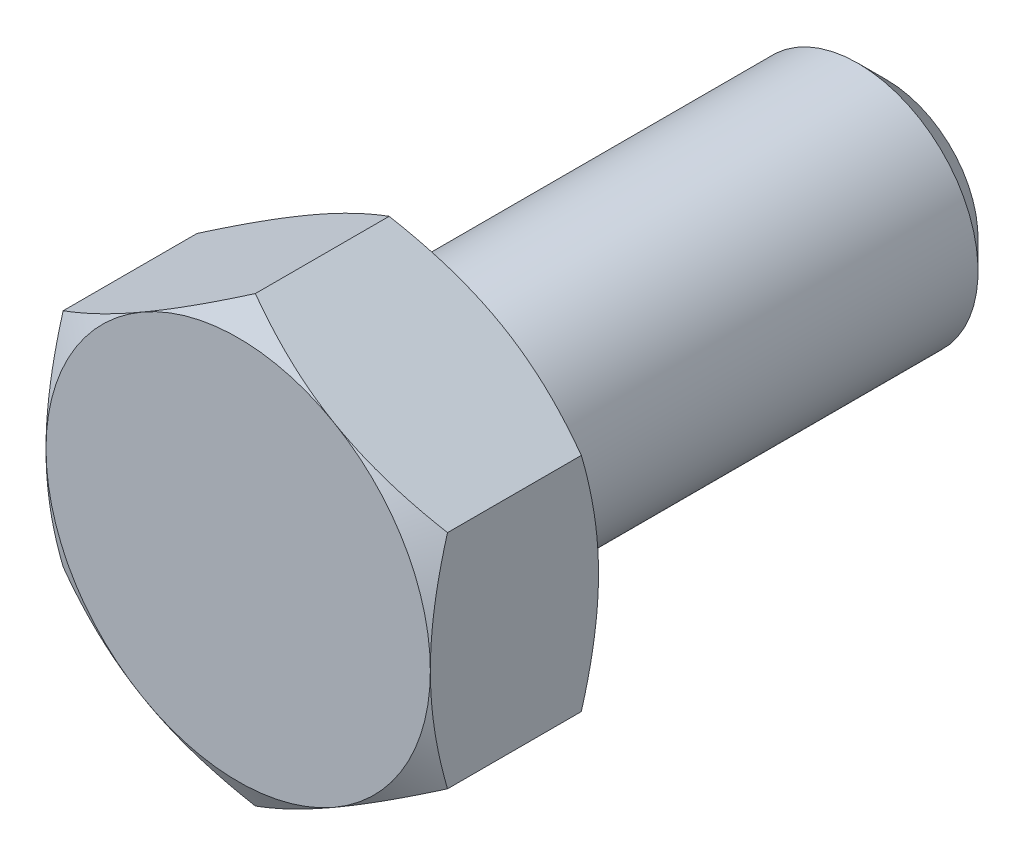
ISO-10303-21;
HEADER;
FILE_DESCRIPTION(('STEP AP214'),'2;1');
FILE_NAME('part.step','',(''),(''),'','','');
FILE_SCHEMA(('AUTOMOTIVE_DESIGN { 1 0 10303 214 1 1 1 1 }'));
ENDSEC;
DATA;
#1=APPLICATION_CONTEXT('core data for automotive mechanical design processes');
#2=APPLICATION_PROTOCOL_DEFINITION('international standard','automotive_design',2000,#1);
#3=PRODUCT_CONTEXT('',#1,'mechanical');
#4=PRODUCT('Part','Part','',(#3));
#5=PRODUCT_RELATED_PRODUCT_CATEGORY('part','',(#4));
#6=PRODUCT_DEFINITION_FORMATION('','',#4);
#7=PRODUCT_DEFINITION_CONTEXT('part definition',#1,'design');
#8=PRODUCT_DEFINITION('design','',#6,#7);
#9=PRODUCT_DEFINITION_SHAPE('','',#8);
#10=(LENGTH_UNIT() NAMED_UNIT(*) SI_UNIT(.MILLI.,.METRE.));
#11=(NAMED_UNIT(*) PLANE_ANGLE_UNIT() SI_UNIT($,.RADIAN.));
#12=(NAMED_UNIT(*) SI_UNIT($,.STERADIAN.) SOLID_ANGLE_UNIT());
#13=UNCERTAINTY_MEASURE_WITH_UNIT(LENGTH_MEASURE(1.E-05),#10,'distance_accuracy_value','');
#14=(GEOMETRIC_REPRESENTATION_CONTEXT(3) GLOBAL_UNCERTAINTY_ASSIGNED_CONTEXT((#13)) GLOBAL_UNIT_ASSIGNED_CONTEXT((#10,
#11,#12)) REPRESENTATION_CONTEXT('',''));
#15=CARTESIAN_POINT('',(0.,0.,0.));
#16=DIRECTION('',(0.,0.,1.));
#17=DIRECTION('',(1.,0.,0.));
#18=AXIS2_PLACEMENT_3D('',#15,#16,#17);
#19=CARTESIAN_POINT('',(4.,2.3094010767585,-15.7202018532156));
#20=DIRECTION('',(0.5,0.866025403784439,0.));
#21=DIRECTION('',(-0.866025403784439,0.5,0.));
#22=AXIS2_PLACEMENT_3D('',#19,#20,#21);
#23=PLANE('',#22);
#24=DIRECTION('',(0.,0.,1.));
#25=VECTOR('',#24,1.);
#26=CARTESIAN_POINT('',(4.,2.3094010767585,-15.7202018532156));
#27=LINE('',#26,#25);
#28=CARTESIAN_POINT('',(4.,2.3094010767585,-3.14273441009184));
#29=VERTEX_POINT('',#28);
#30=CARTESIAN_POINT('',(4.,2.3094010767585,-0.357265589908162));
#31=VERTEX_POINT('',#30);
#32=EDGE_CURVE('E243',#29,#31,#27,.T.);
#33=ORIENTED_EDGE('',*,*,#32,.F.);
#34=CARTESIAN_POINT('',(4.0002,2.30928560670466,-3.14266774092524));
#35=CARTESIAN_POINT('',(3.82442084967677,2.4107717464617,-3.20128212635172));
#36=CARTESIAN_POINT('',(3.64712438367362,2.51313390883499,-3.25458967853774));
#37=CARTESIAN_POINT('',(3.28946140682429,2.71963072479811,-3.3476383292536));
#38=CARTESIAN_POINT('',(3.10908854102985,2.82376904741904,-3.3873465109703));
#39=CARTESIAN_POINT('',(2.75057818129721,3.03075510011795,-3.44915778471973));
#40=CARTESIAN_POINT('',(2.57249584706486,3.13357098372491,-3.47167226847712));
#41=CARTESIAN_POINT('',(2.21549328283349,3.33968651028528,-3.49854937685342));
#42=CARTESIAN_POINT('',(2.0365743503559,3.44298540411433,-3.50293425857306));
#43=CARTESIAN_POINT('',(1.70225715780327,3.63600352522932,-3.49380992706004));
#44=CARTESIAN_POINT('',(1.54680884001294,3.72575165335064,-3.48254104601201));
#45=CARTESIAN_POINT('',(1.23692494436495,3.90466320392054,-3.44682600920182));
#46=CARTESIAN_POINT('',(1.08249043825587,3.99382600759478,-3.42236765428848));
#47=CARTESIAN_POINT('',(0.771967672225422,4.17310641015196,-3.36122393508072));
#48=CARTESIAN_POINT('',(0.615918711936898,4.26320131938131,-3.32427939634515));
#49=CARTESIAN_POINT('',(0.306148164596161,4.4420474282755,-3.24042992745198));
#50=CARTESIAN_POINT('',(0.152422609226221,4.53080091904966,-3.19354469778727));
#51=CARTESIAN_POINT('',(-0.000199999999999762,4.61891762357084,-3.14266774092524));
#52=B_SPLINE_CURVE_WITH_KNOTS('',3,(#34,#35,#36,#37,#38,#39,#40,#41,#42,#43,#44,#45,#46,#47,#48,
#49,#50,#51),.UNSPECIFIED.,.F.,.F.,(4,2,2,2,2,2,2,2,4),(0.,0.634047835695965,1.26961969224543,
1.88946157213122,2.50854226669296,3.04757825393385,3.58711366126903,4.13861653143763,
4.68903648037743),.UNSPECIFIED.);
#53=CARTESIAN_POINT('',(2.,3.46410161513777,-3.5));
#54=VERTEX_POINT('',#53);
#55=EDGE_CURVE('E55',#29,#54,#52,.T.);
#56=ORIENTED_EDGE('',*,*,#55,.T.);
#57=CARTESIAN_POINT('',(0.,4.618802153517,-3.14273441009185));
#58=VERTEX_POINT('',#57);
#59=EDGE_CURVE('E201',#54,#58,#52,.T.);
#60=ORIENTED_EDGE('',*,*,#59,.T.);
#61=DIRECTION('',(0.,0.,1.));
#62=VECTOR('',#61,1.);
#63=CARTESIAN_POINT('',(0.,4.618802153517,-15.7202018532156));
#64=LINE('',#63,#62);
#65=CARTESIAN_POINT('',(0.,4.618802153517,-0.357265589908161));
#66=VERTEX_POINT('',#65);
#67=EDGE_CURVE('E250',#58,#66,#64,.T.);
#68=ORIENTED_EDGE('',*,*,#67,.T.);
#69=CARTESIAN_POINT('',(-0.000200000000000386,4.61891762357084,-0.357332259074766));
#70=CARTESIAN_POINT('',(0.175579150323227,4.5174314838138,-0.298717873648281));
#71=CARTESIAN_POINT('',(0.352875616326379,4.41506932144051,-0.245410321462262));
#72=CARTESIAN_POINT('',(0.710538593175705,4.20857250547739,-0.152361670746403));
#73=CARTESIAN_POINT('',(0.89091145897015,4.10443418285646,-0.112653489029704));
#74=CARTESIAN_POINT('',(1.24942181870279,3.89744813015756,-0.0508422152802788));
#75=CARTESIAN_POINT('',(1.42750415293514,3.79463224655059,-0.0283277315228885));
#76=CARTESIAN_POINT('',(1.78450671716651,3.58851671999022,-0.00145062314658153));
#77=CARTESIAN_POINT('',(1.9634256496441,3.48521782616117,0.00293425857305705));
#78=CARTESIAN_POINT('',(2.29774284219673,3.29219970504618,-0.00619007293996993));
#79=CARTESIAN_POINT('',(2.45319115998706,3.20245157692486,-0.0174589539879939));
#80=CARTESIAN_POINT('',(2.76307505563505,3.02354002635496,-0.0531739907981927));
#81=CARTESIAN_POINT('',(2.91750956174413,2.93437722268072,-0.0776323457115325));
#82=CARTESIAN_POINT('',(3.22803232777457,2.75509682012354,-0.138776064919289));
#83=CARTESIAN_POINT('',(3.3840812880631,2.6650019108942,-0.175720603654863));
#84=CARTESIAN_POINT('',(3.69385183540384,2.486155802,-0.259570072548026));
#85=CARTESIAN_POINT('',(3.84757739077378,2.39740231122584,-0.306455302212739));
#86=CARTESIAN_POINT('',(4.0002,2.30928560670466,-0.357332259074765));
#87=B_SPLINE_CURVE_WITH_KNOTS('',3,(#69,#70,#71,#72,#73,#74,#75,#76,#77,#78,#79,#80,#81,#82,#83,
#84,#85,#86),.UNSPECIFIED.,.F.,.F.,(4,2,2,2,2,2,2,2,4),(0.,0.634047835695965,1.26961969224543,
1.88946157213122,2.50854226669297,3.04757825393385,3.58711366126903,4.13861653143763,
4.68903648037743),.UNSPECIFIED.);
#88=CARTESIAN_POINT('',(2.,3.46410161513775,0.));
#89=VERTEX_POINT('',#88);
#90=EDGE_CURVE('E359',#66,#89,#87,.T.);
#91=ORIENTED_EDGE('',*,*,#90,.T.);
#92=EDGE_CURVE('E282',#89,#31,#87,.T.);
#93=ORIENTED_EDGE('',*,*,#92,.T.);
#94=EDGE_LOOP('',(#33,#56,#60,#68,#91,#93));
#95=FACE_BOUND('',#94,.T.);
#96=ADVANCED_FACE('F36',(#95),#23,.T.);
#97=CARTESIAN_POINT('',(0.,4.618802153517,-15.7202018532156));
#98=DIRECTION('',(-0.5,0.866025403784439,0.));
#99=DIRECTION('',(-0.866025403784439,-0.5,0.));
#100=AXIS2_PLACEMENT_3D('',#97,#98,#99);
#101=PLANE('',#100);
#102=ORIENTED_EDGE('',*,*,#67,.F.);
#103=CARTESIAN_POINT('',(0.000199999999999681,4.61891762357084,-3.14266774092524));
#104=CARTESIAN_POINT('',(-0.175579150323227,4.5174314838138,-3.20128212635173));
#105=CARTESIAN_POINT('',(-0.35287561632638,4.41506932144051,-3.25458967853775));
#106=CARTESIAN_POINT('',(-0.710538593175704,4.20857250547739,-3.3476383292536));
#107=CARTESIAN_POINT('',(-0.890911458970148,4.10443418285646,-3.3873465109703));
#108=CARTESIAN_POINT('',(-1.24942181870279,3.89744813015756,-3.44915778471973));
#109=CARTESIAN_POINT('',(-1.42750415293514,3.79463224655059,-3.47167226847712));
#110=CARTESIAN_POINT('',(-1.7845067171665,3.58851671999023,-3.49854937685342));
#111=CARTESIAN_POINT('',(-1.96342564964409,3.48521782616117,-3.50293425857306));
#112=CARTESIAN_POINT('',(-2.29774284219672,3.29219970504619,-3.49380992706004));
#113=CARTESIAN_POINT('',(-2.45319115998706,3.20245157692486,-3.48254104601201));
#114=CARTESIAN_POINT('',(-2.76307505563505,3.02354002635497,-3.44682600920181));
#115=CARTESIAN_POINT('',(-2.91750956174412,2.93437722268073,-3.42236765428847));
#116=CARTESIAN_POINT('',(-3.22803232777457,2.75509682012354,-3.36122393508072));
#117=CARTESIAN_POINT('',(-3.3840812880631,2.6650019108942,-3.32427939634514));
#118=CARTESIAN_POINT('',(-3.69385183540383,2.48615580200001,-3.24042992745198));
#119=CARTESIAN_POINT('',(-3.84757739077377,2.39740231122585,-3.19354469778726));
#120=CARTESIAN_POINT('',(-4.0002,2.30928560670466,-3.14266774092524));
#121=B_SPLINE_CURVE_WITH_KNOTS('',3,(#103,#104,#105,#106,#107,#108,#109,#110,#111,#112,#113,
#114,#115,#116,#117,#118,#119,#120),.UNSPECIFIED.,.F.,.F.,(4,2,2,2,2,2,2,2,4),(0.,
0.634047835695963,1.26961969224543,1.88946157213121,2.50854226669296,3.04757825393385,
3.58711366126902,4.13861653143763,4.68903648037743),.UNSPECIFIED.);
#122=CARTESIAN_POINT('',(-2.,3.46410161513777,-3.5));
#123=VERTEX_POINT('',#122);
#124=EDGE_CURVE('E199',#58,#123,#121,.T.);
#125=ORIENTED_EDGE('',*,*,#124,.T.);
#126=CARTESIAN_POINT('',(-4.,2.3094010767585,-3.14273441009184));
#127=VERTEX_POINT('',#126);
#128=EDGE_CURVE('E192',#123,#127,#121,.T.);
#129=ORIENTED_EDGE('',*,*,#128,.T.);
#130=DIRECTION('',(0.,0.,1.));
#131=VECTOR('',#130,1.);
#132=CARTESIAN_POINT('',(-4.,2.3094010767585,-15.7202018532156));
#133=LINE('',#132,#131);
#134=CARTESIAN_POINT('',(-4.,2.3094010767585,-0.357265589908162));
#135=VERTEX_POINT('',#134);
#136=EDGE_CURVE('E248',#127,#135,#133,.T.);
#137=ORIENTED_EDGE('',*,*,#136,.T.);
#138=CARTESIAN_POINT('',(-4.0002,2.30928560670466,-0.357332259074766));
#139=CARTESIAN_POINT('',(-3.82442084967677,2.4107717464617,-0.298717873648282));
#140=CARTESIAN_POINT('',(-3.64712438367362,2.51313390883499,-0.245410321462262));
#141=CARTESIAN_POINT('',(-3.28946140682429,2.71963072479811,-0.152361670746403));
#142=CARTESIAN_POINT('',(-3.10908854102985,2.82376904741904,-0.112653489029704));
#143=CARTESIAN_POINT('',(-2.75057818129721,3.03075510011795,-0.0508422152802791));
#144=CARTESIAN_POINT('',(-2.57249584706485,3.13357098372491,-0.0283277315228889));
#145=CARTESIAN_POINT('',(-2.21549328283349,3.33968651028528,-0.00145062314658193));
#146=CARTESIAN_POINT('',(-2.0365743503559,3.44298540411434,0.00293425857305657));
#147=CARTESIAN_POINT('',(-1.70225715780327,3.63600352522932,-0.00619007293997032));
#148=CARTESIAN_POINT('',(-1.54680884001293,3.72575165335064,-0.0174589539879941));
#149=CARTESIAN_POINT('',(-1.23692494436494,3.90466320392054,-0.0531739907981928));
#150=CARTESIAN_POINT('',(-1.08249043825587,3.99382600759478,-0.0776323457115326));
#151=CARTESIAN_POINT('',(-0.771967672225421,4.17310641015197,-0.138776064919289));
#152=CARTESIAN_POINT('',(-0.615918711936897,4.26320131938131,-0.175720603654863));
#153=CARTESIAN_POINT('',(-0.30614816459616,4.4420474282755,-0.259570072548026));
#154=CARTESIAN_POINT('',(-0.15242260922622,4.53080091904966,-0.306455302212739));
#155=CARTESIAN_POINT('',(0.000199999999999935,4.61891762357084,-0.357332259074766));
#156=B_SPLINE_CURVE_WITH_KNOTS('',3,(#138,#139,#140,#141,#142,#143,#144,#145,#146,#147,#148,
#149,#150,#151,#152,#153,#154,#155),.UNSPECIFIED.,.F.,.F.,(4,2,2,2,2,2,2,2,4),(0.,
0.634047835695965,1.26961969224543,1.88946157213122,2.50854226669297,3.04757825393385,
3.58711366126903,4.13861653143763,4.68903648037742),.UNSPECIFIED.);
#157=CARTESIAN_POINT('',(-2.,3.46410161513775,0.));
#158=VERTEX_POINT('',#157);
#159=EDGE_CURVE('E226',#135,#158,#156,.T.);
#160=ORIENTED_EDGE('',*,*,#159,.T.);
#161=EDGE_CURVE('E218',#158,#66,#156,.T.);
#162=ORIENTED_EDGE('',*,*,#161,.T.);
#163=EDGE_LOOP('',(#102,#125,#129,#137,#160,#162));
#164=FACE_BOUND('',#163,.T.);
#165=ADVANCED_FACE('F208',(#164),#101,.T.);
#166=CARTESIAN_POINT('',(-4.,2.3094010767585,-15.7202018532156));
#167=DIRECTION('',(-1.,0.,0.));
#168=DIRECTION('',(0.,-1.,0.));
#169=AXIS2_PLACEMENT_3D('',#166,#167,#168);
#170=PLANE('',#169);
#171=ORIENTED_EDGE('',*,*,#136,.F.);
#172=CARTESIAN_POINT('',(-3.99999999999999,-6.32016209167169,-1.49105074107846));
#173=CARTESIAN_POINT('',(-3.99999999999999,-6.14442149702396,-1.57676392713943));
#174=CARTESIAN_POINT('',(-3.99999999999999,-5.96828976819917,-1.66168830366029));
#175=CARTESIAN_POINT('',(-3.99999999999999,-5.6150364271374,-1.8295179426069));
#176=CARTESIAN_POINT('',(-3.99999999999999,-5.43791467397107,-1.91242290808154));
#177=CARTESIAN_POINT('',(-3.99999999999999,-5.08161610121575,-2.07616457535033));
#178=CARTESIAN_POINT('',(-3.99999999999999,-4.90243340413564,-2.15698853008215));
#179=CARTESIAN_POINT('',(-3.99999999999999,-4.54268290767781,-2.3154807143253));
#180=CARTESIAN_POINT('',(-3.99999999999999,-4.36211517095867,-2.3931490856045));
#181=CARTESIAN_POINT('',(-3.99999999999999,-3.9930904680581,-2.54709429031087));
#182=CARTESIAN_POINT('',(-3.99999999999999,-3.80457523185055,-2.62323217578829));
#183=CARTESIAN_POINT('',(-3.99999999999999,-3.42538286686113,-2.77002330543647));
#184=CARTESIAN_POINT('',(-3.99999999999999,-3.23470550466733,-2.84067595086277));
#185=CARTESIAN_POINT('',(-3.99999999999999,-2.85120603775022,-2.9747272208741));
#186=CARTESIAN_POINT('',(-3.99999999999999,-2.65838877563998,-3.03813956559246));
#187=CARTESIAN_POINT('',(-3.99999999999999,-2.26999073863816,-3.15575322998857));
#188=CARTESIAN_POINT('',(-3.99999999999999,-2.07441081710036,-3.2099573293936));
#189=CARTESIAN_POINT('',(-3.99999999999999,-1.68146389161059,-3.30634238866102));
#190=CARTESIAN_POINT('',(-3.99999999999999,-1.48411388926011,-3.34859141992628));
#191=CARTESIAN_POINT('',(-3.99999999999999,-1.08684206068505,-3.41875684620224));
#192=CARTESIAN_POINT('',(-3.99999999999999,-0.886920521948228,-3.44667482933569));
#193=CARTESIAN_POINT('',(-3.99999999999999,-0.488161426014666,-3.48559194389896));
#194=CARTESIAN_POINT('',(-3.99999999999999,-0.289346538603001,-3.49681761285646));
#195=CARTESIAN_POINT('',(-3.99999999999999,0.108530476225969,-3.50200277845589));
#196=CARTESIAN_POINT('',(-4.,0.307592606618809,-3.49596206524675));
#197=CARTESIAN_POINT('',(-4.,0.642130475107847,-3.47173841922704));
#198=CARTESIAN_POINT('',(-4.,0.777947620408235,-3.45796321205855));
#199=CARTESIAN_POINT('',(-4.,1.0486572297254,-3.42317125644127));
#200=CARTESIAN_POINT('',(-4.,1.1835495784856,-3.4021536215259));
#201=CARTESIAN_POINT('',(-4.,1.58661718344233,-3.32933470578363));
#202=CARTESIAN_POINT('',(-4.,1.85305348856052,-3.2677780981361));
#203=CARTESIAN_POINT('',(-4.,2.25169312531492,-3.16013293278123));
#204=CARTESIAN_POINT('',(-4.,2.38593642433857,-3.12116080495104));
#205=CARTESIAN_POINT('',(-4.,2.6531212279537,-3.03894486121903));
#206=CARTESIAN_POINT('',(-4.,2.78606272227749,-2.99570101165472));
#207=CARTESIAN_POINT('',(-4.,3.05068341673894,-2.90565399900881));
#208=CARTESIAN_POINT('',(-4.,3.18236294821461,-2.8588518007264));
#209=CARTESIAN_POINT('',(-4.,3.4446147345196,-2.76226098645699));
#210=CARTESIAN_POINT('',(-4.,3.57518701639591,-2.71247244365925));
#211=CARTESIAN_POINT('',(-4.,3.9317779877162,-2.57257226372842));
#212=CARTESIAN_POINT('',(-4.,4.15680215889641,-2.47992787487726));
#213=CARTESIAN_POINT('',(-4.,4.60447894762886,-2.28905562808645));
#214=CARTESIAN_POINT('',(-4.,4.82713127940099,-2.19082710615753));
#215=CARTESIAN_POINT('',(-4.,5.27061186064789,-1.99013448871895));
#216=CARTESIAN_POINT('',(-4.,5.49143940180586,-1.88766883337288));
#217=CARTESIAN_POINT('',(-4.,5.9315773473081,-1.67952247404667));
#218=CARTESIAN_POINT('',(-4.,6.15088770262694,-1.57384166676415));
#219=CARTESIAN_POINT('',(-4.,6.58864452407791,-1.3598068453538));
#220=CARTESIAN_POINT('',(-4.,6.8070889759552,-1.25144872021888));
#221=CARTESIAN_POINT('',(-4.,7.24298360713141,-1.03274864625662));
#222=CARTESIAN_POINT('',(-4.,7.46043377556052,-0.922406675806022));
#223=CARTESIAN_POINT('',(-4.,8.11147090837924,-0.58907300979237));
#224=CARTESIAN_POINT('',(-4.,8.54384921320082,-0.363721848812851));
#225=CARTESIAN_POINT('',(-4.,9.35956992542861,0.0664624700838824));
#226=CARTESIAN_POINT('',(-4.,9.74313951878204,0.270866949404765));
#227=CARTESIAN_POINT('',(-4.,10.5090013046551,0.68211422230123));
#228=CARTESIAN_POINT('',(-4.,10.891293411187,0.888957175930557));
#229=CARTESIAN_POINT('',(-4.,11.6535663577344,1.30371780708475));
#230=CARTESIAN_POINT('',(-4.,12.0335506091698,1.51162922476384));
#231=CARTESIAN_POINT('',(-4.,12.7927224899333,1.92882752253896));
#232=CARTESIAN_POINT('',(-4.,13.1719101828134,2.13811428694318));
#233=CARTESIAN_POINT('',(-4.,13.5508195830903,2.34790058848722));
#234=B_SPLINE_CURVE_WITH_KNOTS('',3,(#172,#173,#174,#175,#176,#177,#178,#179,#180,#181,#182,
#183,#184,#185,#186,#187,#188,#189,#190,#191,#192,#193,#194,#195,#196,#197,#198,#199,#200,#201,
#202,#203,#204,#205,#206,#207,#208,#209,#210,#211,#212,#213,#214,#215,#216,#217,#218,#219,#220,
#221,#222,#223,#224,#225,#226,#227,#228,#229,#230,#231,#232,#233),.UNSPECIFIED.,.F.,.F.,(4,2,2,
2,2,2,2,2,2,2,2,2,2,2,2,2,2,2,2,2,2,2,2,2,2,2,2,2,2,2,4),(0.,0.586592990342611,1.17327172376719,
1.76295108401691,2.35260392294654,2.96246799799956,3.57239854978571,4.18115341667835,
4.78972418866007,5.39475667094271,5.99972209090181,6.59639988960821,7.19308494021114,
7.60243041070037,8.01182600251118,8.83100524773864,9.2503240168675,9.66964609062222,
10.0888548734385,10.5080533864878,11.2379871699955,11.9680079295992,12.6982998704432,
13.4286153002971,14.1601319598301,14.8916565974948,16.354355556011,17.6582490932156,
18.9622286957155,20.261662748548,21.5609888597796),.UNSPECIFIED.);
#235=CARTESIAN_POINT('',(-4.,0.,-3.5));
#236=VERTEX_POINT('',#235);
#237=EDGE_CURVE('E200',#127,#236,#234,.F.);
#238=ORIENTED_EDGE('',*,*,#237,.T.);
#239=CARTESIAN_POINT('',(-3.99999999999999,-2.3094010767585,-3.14273441009183));
#240=VERTEX_POINT('',#239);
#241=EDGE_CURVE('E185',#236,#240,#234,.F.);
#242=ORIENTED_EDGE('',*,*,#241,.T.);
#243=DIRECTION('',(0.,0.,1.));
#244=VECTOR('',#243,1.);
#245=CARTESIAN_POINT('',(-3.99999999999999,-2.3094010767585,-15.7202018532156));
#246=LINE('',#245,#244);
#247=CARTESIAN_POINT('',(-3.99999999999999,-2.3094010767585,-0.357265589908161));
#248=VERTEX_POINT('',#247);
#249=EDGE_CURVE('E246',#240,#248,#246,.T.);
#250=ORIENTED_EDGE('',*,*,#249,.T.);
#251=CARTESIAN_POINT('',(-3.99999999999999,-6.32016209167169,-2.00894925892153));
#252=CARTESIAN_POINT('',(-3.99999999999999,-6.14442149702395,-1.92323607286055));
#253=CARTESIAN_POINT('',(-3.99999999999999,-5.96828976819917,-1.8383116963397));
#254=CARTESIAN_POINT('',(-3.99999999999999,-5.6150364271374,-1.67048205739309));
#255=CARTESIAN_POINT('',(-3.99999999999999,-5.43791467397107,-1.58757709191845));
#256=CARTESIAN_POINT('',(-3.99999999999999,-5.08161610121575,-1.42383542464966));
#257=CARTESIAN_POINT('',(-3.99999999999999,-4.90243340413564,-1.34301146991784));
#258=CARTESIAN_POINT('',(-3.99999999999999,-4.54268290767781,-1.18451928567469));
#259=CARTESIAN_POINT('',(-3.99999999999999,-4.36211517095866,-1.10685091439549));
#260=CARTESIAN_POINT('',(-3.99999999999999,-3.9930904680581,-0.952905709689124));
#261=CARTESIAN_POINT('',(-3.99999999999999,-3.80457523185055,-0.876767824211705));
#262=CARTESIAN_POINT('',(-3.99999999999999,-3.42538286686113,-0.729976694563518));
#263=CARTESIAN_POINT('',(-3.99999999999999,-3.23470550466733,-0.65932404913722));
#264=CARTESIAN_POINT('',(-3.99999999999999,-2.85120603775021,-0.525272779125896));
#265=CARTESIAN_POINT('',(-3.99999999999999,-2.65838877563998,-0.461860434407535));
#266=CARTESIAN_POINT('',(-3.99999999999999,-2.26999073863816,-0.344246770011421));
#267=CARTESIAN_POINT('',(-3.99999999999999,-2.07441081710036,-0.290042670606394));
#268=CARTESIAN_POINT('',(-3.99999999999999,-1.68146389161059,-0.193657611338974));
#269=CARTESIAN_POINT('',(-3.99999999999999,-1.48411388926011,-0.151408580073716));
#270=CARTESIAN_POINT('',(-3.99999999999999,-1.08684206068505,-0.0812431537977509));
#271=CARTESIAN_POINT('',(-3.99999999999999,-0.886920521948228,-0.0533251706643067));
#272=CARTESIAN_POINT('',(-3.99999999999999,-0.488161426014666,-0.0144080561010356));
#273=CARTESIAN_POINT('',(-3.99999999999999,-0.289346538603002,-0.00318238714354086));
#274=CARTESIAN_POINT('',(-3.99999999999999,0.108530476225967,0.00200277845589641));
#275=CARTESIAN_POINT('',(-4.,0.307592606618807,-0.00403793475324769));
#276=CARTESIAN_POINT('',(-4.,0.642130475107845,-0.0282615807729549));
#277=CARTESIAN_POINT('',(-4.,0.777947620408234,-0.0420367879414466));
#278=CARTESIAN_POINT('',(-4.,1.0486572297254,-0.0768287435587269));
#279=CARTESIAN_POINT('',(-4.,1.1835495784856,-0.0978463784740998));
#280=CARTESIAN_POINT('',(-4.,1.58661718344234,-0.17066529421637));
#281=CARTESIAN_POINT('',(-4.,1.85305348856052,-0.232221901863901));
#282=CARTESIAN_POINT('',(-4.,2.25169312531493,-0.339867067218777));
#283=CARTESIAN_POINT('',(-4.,2.38593642433857,-0.378839195048967));
#284=CARTESIAN_POINT('',(-4.,2.6531212279537,-0.461055138780976));
#285=CARTESIAN_POINT('',(-4.,2.7860627222775,-0.504298988345288));
#286=CARTESIAN_POINT('',(-4.,3.05068341673894,-0.5943460009912));
#287=CARTESIAN_POINT('',(-4.,3.18236294821462,-0.641148199273603));
#288=CARTESIAN_POINT('',(-4.,3.4446147345196,-0.73773901354302));
#289=CARTESIAN_POINT('',(-4.,3.57518701639591,-0.787527556340753));
#290=CARTESIAN_POINT('',(-4.,3.93177798771621,-0.927427736271582));
#291=CARTESIAN_POINT('',(-4.,4.15680215889641,-1.02007212512274));
#292=CARTESIAN_POINT('',(-4.,4.60447894762886,-1.21094437191355));
#293=CARTESIAN_POINT('',(-4.,4.82713127940099,-1.30917289384247));
#294=CARTESIAN_POINT('',(-4.,5.2706118606479,-1.50986551128106));
#295=CARTESIAN_POINT('',(-4.,5.49143940180586,-1.61233116662713));
#296=CARTESIAN_POINT('',(-4.,5.9315773473081,-1.82047752595334));
#297=CARTESIAN_POINT('',(-4.,6.15088770262694,-1.92615833323585));
#298=CARTESIAN_POINT('',(-4.,6.58864452407791,-2.14019315464621));
#299=CARTESIAN_POINT('',(-4.,6.8070889759552,-2.24855127978113));
#300=CARTESIAN_POINT('',(-4.,7.24298360713141,-2.46725135374339));
#301=CARTESIAN_POINT('',(-4.,7.46043377556052,-2.57759332419399));
#302=CARTESIAN_POINT('',(-4.,8.11147090837924,-2.91092699020764));
#303=CARTESIAN_POINT('',(-4.,8.54384921320083,-3.13627815118716));
#304=CARTESIAN_POINT('',(-4.,9.35956992542861,-3.56646247008389));
#305=CARTESIAN_POINT('',(-4.,9.74313951878205,-3.77086694940478));
#306=CARTESIAN_POINT('',(-4.,10.5090013046551,-4.18211422230124));
#307=CARTESIAN_POINT('',(-4.,10.891293411187,-4.38895717593057));
#308=CARTESIAN_POINT('',(-4.,11.6535663577344,-4.80371780708476));
#309=CARTESIAN_POINT('',(-4.,12.0335506091698,-5.01162922476385));
#310=CARTESIAN_POINT('',(-4.,12.7927224899333,-5.42882752253897));
#311=CARTESIAN_POINT('',(-4.,13.1719101828134,-5.6381142869432));
#312=CARTESIAN_POINT('',(-4.,13.5508195830903,-5.84790058848723));
#313=B_SPLINE_CURVE_WITH_KNOTS('',3,(#251,#252,#253,#254,#255,#256,#257,#258,#259,#260,#261,
#262,#263,#264,#265,#266,#267,#268,#269,#270,#271,#272,#273,#274,#275,#276,#277,#278,#279,#280,
#281,#282,#283,#284,#285,#286,#287,#288,#289,#290,#291,#292,#293,#294,#295,#296,#297,#298,#299,
#300,#301,#302,#303,#304,#305,#306,#307,#308,#309,#310,#311,#312),.UNSPECIFIED.,.F.,.F.,(4,2,2,
2,2,2,2,2,2,2,2,2,2,2,2,2,2,2,2,2,2,2,2,2,2,2,2,2,2,2,4),(0.,0.586592990342609,1.17327172376719,
1.76295108401691,2.35260392294653,2.96246799799956,3.57239854978571,4.18115341667835,
4.78972418866006,5.3947566709427,5.99972209090181,6.5963998896082,7.19308494021113,
7.60243041070036,8.01182600251117,8.83100524773863,9.25032401686749,9.66964609062222,
10.0888548734385,10.5080533864878,11.2379871699955,11.9680079295992,12.6982998704432,
13.4286153002971,14.1601319598301,14.8916565974948,16.354355556011,17.6582490932156,
18.9622286957155,20.261662748548,21.5609888597796),.UNSPECIFIED.);
#314=CARTESIAN_POINT('',(-4.,0.,0.));
#315=VERTEX_POINT('',#314);
#316=EDGE_CURVE('E240',#248,#315,#313,.T.);
#317=ORIENTED_EDGE('',*,*,#316,.T.);
#318=EDGE_CURVE('E233',#315,#135,#313,.T.);
#319=ORIENTED_EDGE('',*,*,#318,.T.);
#320=EDGE_LOOP('',(#171,#238,#242,#250,#317,#319));
#321=FACE_BOUND('',#320,.T.);
#322=ADVANCED_FACE('F211',(#321),#170,.T.);
#323=CARTESIAN_POINT('',(-3.99999999999999,-2.3094010767585,-15.7202018532156));
#324=DIRECTION('',(-0.5,-0.866025403784439,0.));
#325=DIRECTION('',(0.866025403784439,-0.5,0.));
#326=AXIS2_PLACEMENT_3D('',#323,#324,#325);
#327=PLANE('',#326);
#328=ORIENTED_EDGE('',*,*,#249,.F.);
#329=CARTESIAN_POINT('',(-4.00019999999999,-2.30928560670466,-3.14266774092523));
#330=CARTESIAN_POINT('',(-3.82442084967677,-2.4107717464617,-3.20128212635171));
#331=CARTESIAN_POINT('',(-3.64712438367361,-2.51313390883499,-3.25458967853773));
#332=CARTESIAN_POINT('',(-3.28946140682429,-2.71963072479811,-3.34763832925359));
#333=CARTESIAN_POINT('',(-3.10908854102984,-2.82376904741904,-3.38734651097029));
#334=CARTESIAN_POINT('',(-2.7505781812972,-3.03075510011795,-3.44915778471971));
#335=CARTESIAN_POINT('',(-2.57249584706485,-3.13357098372492,-3.4716722684771));
#336=CARTESIAN_POINT('',(-2.21549328283348,-3.33968651028528,-3.49854937685341));
#337=CARTESIAN_POINT('',(-2.03657435035589,-3.44298540411434,-3.50293425857305));
#338=CARTESIAN_POINT('',(-1.70225715780326,-3.63600352522932,-3.49380992706002));
#339=CARTESIAN_POINT('',(-1.54680884001293,-3.72575165335064,-3.48254104601199));
#340=CARTESIAN_POINT('',(-1.23692494436494,-3.90466320392054,-3.4468260092018));
#341=CARTESIAN_POINT('',(-1.08249043825586,-3.99382600759478,-3.42236765428846));
#342=CARTESIAN_POINT('',(-0.771967672225418,-4.17310641015197,-3.3612239350807));
#343=CARTESIAN_POINT('',(-0.615918711936895,-4.26320131938131,-3.32427939634512));
#344=CARTESIAN_POINT('',(-0.306148164596159,-4.4420474282755,-3.24042992745196));
#345=CARTESIAN_POINT('',(-0.15242260922622,-4.53080091904966,-3.19354469778725));
#346=CARTESIAN_POINT('',(0.000200000000000112,-4.61891762357084,-3.14266774092522));
#347=B_SPLINE_CURVE_WITH_KNOTS('',3,(#329,#330,#331,#332,#333,#334,#335,#336,#337,#338,#339,
#340,#341,#342,#343,#344,#345,#346),.UNSPECIFIED.,.F.,.F.,(4,2,2,2,2,2,2,2,4),(0.,
0.634047835695967,1.26961969224544,1.88946157213122,2.50854226669297,3.04757825393386,
3.58711366126903,4.13861653143763,4.68903648037742),.UNSPECIFIED.);
#348=CARTESIAN_POINT('',(-2.,-3.46410161513773,-3.5));
#349=VERTEX_POINT('',#348);
#350=EDGE_CURVE('E329',#240,#349,#347,.T.);
#351=ORIENTED_EDGE('',*,*,#350,.T.);
#352=CARTESIAN_POINT('',(0.,-4.618802153517,-3.14273441009183));
#353=VERTEX_POINT('',#352);
#354=EDGE_CURVE('E178',#349,#353,#347,.T.);
#355=ORIENTED_EDGE('',*,*,#354,.T.);
#356=DIRECTION('',(0.,0.,1.));
#357=VECTOR('',#356,1.);
#358=CARTESIAN_POINT('',(0.,-4.618802153517,-15.7202018532156));
#359=LINE('',#358,#357);
#360=CARTESIAN_POINT('',(0.,-4.618802153517,-0.357265589908161));
#361=VERTEX_POINT('',#360);
#362=EDGE_CURVE('E244',#353,#361,#359,.T.);
#363=ORIENTED_EDGE('',*,*,#362,.T.);
#364=CARTESIAN_POINT('',(0.000200000000000131,-4.61891762357084,-0.357332259074766));
#365=CARTESIAN_POINT('',(-0.175579150323227,-4.5174314838138,-0.298717873648281));
#366=CARTESIAN_POINT('',(-0.35287561632638,-4.41506932144051,-0.245410321462261));
#367=CARTESIAN_POINT('',(-0.710538593175705,-4.20857250547739,-0.152361670746403));
#368=CARTESIAN_POINT('',(-0.89091145897015,-4.10443418285646,-0.112653489029704));
#369=CARTESIAN_POINT('',(-1.24942181870279,-3.89744813015755,-0.0508422152802787));
#370=CARTESIAN_POINT('',(-1.42750415293514,-3.79463224655059,-0.0283277315228885));
#371=CARTESIAN_POINT('',(-1.78450671716651,-3.58851671999022,-0.00145062314658154));
#372=CARTESIAN_POINT('',(-1.9634256496441,-3.48521782616117,0.00293425857305705));
#373=CARTESIAN_POINT('',(-2.29774284219673,-3.29219970504618,-0.00619007293996979));
#374=CARTESIAN_POINT('',(-2.45319115998706,-3.20245157692486,-0.0174589539879936));
#375=CARTESIAN_POINT('',(-2.76307505563505,-3.02354002635496,-0.0531739907981924));
#376=CARTESIAN_POINT('',(-2.91750956174413,-2.93437722268072,-0.0776323457115324));
#377=CARTESIAN_POINT('',(-3.22803232777457,-2.75509682012354,-0.138776064919288));
#378=CARTESIAN_POINT('',(-3.3840812880631,-2.6650019108942,-0.175720603654862));
#379=CARTESIAN_POINT('',(-3.69385183540383,-2.486155802,-0.259570072548025));
#380=CARTESIAN_POINT('',(-3.84757739077377,-2.39740231122584,-0.306455302212738));
#381=CARTESIAN_POINT('',(-4.0002,-2.30928560670466,-0.357332259074765));
#382=B_SPLINE_CURVE_WITH_KNOTS('',3,(#364,#365,#366,#367,#368,#369,#370,#371,#372,#373,#374,
#375,#376,#377,#378,#379,#380,#381),.UNSPECIFIED.,.F.,.F.,(4,2,2,2,2,2,2,2,4),(0.,
0.634047835695966,1.26961969224543,1.88946157213122,2.50854226669297,3.04757825393385,
3.58711366126903,4.13861653143763,4.68903648037743),.UNSPECIFIED.);
#383=CARTESIAN_POINT('',(-2.,-3.46410161513775,0.));
#384=VERTEX_POINT('',#383);
#385=EDGE_CURVE('E227',#361,#384,#382,.T.);
#386=ORIENTED_EDGE('',*,*,#385,.T.);
#387=EDGE_CURVE('E241',#384,#248,#382,.T.);
#388=ORIENTED_EDGE('',*,*,#387,.T.);
#389=EDGE_LOOP('',(#328,#351,#355,#363,#386,#388));
#390=FACE_BOUND('',#389,.T.);
#391=ADVANCED_FACE('F314',(#390),#327,.T.);
#392=CARTESIAN_POINT('',(0.,-4.618802153517,-15.7202018532156));
#393=DIRECTION('',(0.5,-0.866025403784439,0.));
#394=DIRECTION('',(0.866025403784439,0.5,0.));
#395=AXIS2_PLACEMENT_3D('',#392,#393,#394);
#396=PLANE('',#395);
#397=ORIENTED_EDGE('',*,*,#362,.F.);
#398=CARTESIAN_POINT('',(-0.000200000000000056,-4.61891762357084,-3.14266774092522));
#399=CARTESIAN_POINT('',(0.175579150323228,-4.5174314838138,-3.20128212635171));
#400=CARTESIAN_POINT('',(0.352875616326381,-4.41506932144051,-3.25458967853773));
#401=CARTESIAN_POINT('',(0.710538593175708,-4.20857250547739,-3.34763832925359));
#402=CARTESIAN_POINT('',(0.890911458970153,-4.10443418285646,-3.38734651097028));
#403=CARTESIAN_POINT('',(1.24942181870279,-3.89744813015755,-3.44915778471971));
#404=CARTESIAN_POINT('',(1.42750415293515,-3.79463224655059,-3.4716722684771));
#405=CARTESIAN_POINT('',(1.78450671716651,-3.58851671999022,-3.49854937685341));
#406=CARTESIAN_POINT('',(1.96342564964411,-3.48521782616116,-3.50293425857305));
#407=CARTESIAN_POINT('',(2.29774284219674,-3.29219970504618,-3.49380992706002));
#408=CARTESIAN_POINT('',(2.45319115998707,-3.20245157692486,-3.48254104601199));
#409=CARTESIAN_POINT('',(2.76307505563506,-3.02354002635496,-3.4468260092018));
#410=CARTESIAN_POINT('',(2.91750956174413,-2.93437722268072,-3.42236765428846));
#411=CARTESIAN_POINT('',(3.22803232777458,-2.75509682012354,-3.3612239350807));
#412=CARTESIAN_POINT('',(3.3840812880631,-2.6650019108942,-3.32427939634513));
#413=CARTESIAN_POINT('',(3.69385183540384,-2.486155802,-3.24042992745197));
#414=CARTESIAN_POINT('',(3.84757739077378,-2.39740231122584,-3.19354469778725));
#415=CARTESIAN_POINT('',(4.0002,-2.30928560670466,-3.14266774092523));
#416=B_SPLINE_CURVE_WITH_KNOTS('',3,(#398,#399,#400,#401,#402,#403,#404,#405,#406,#407,#408,
#409,#410,#411,#412,#413,#414,#415),.UNSPECIFIED.,.F.,.F.,(4,2,2,2,2,2,2,2,4),(0.,
0.634047835695967,1.26961969224544,1.88946157213123,2.50854226669298,3.04757825393386,
3.58711366126903,4.13861653143764,4.68903648037743),.UNSPECIFIED.);
#417=CARTESIAN_POINT('',(2.,-3.46410161513773,-3.5));
#418=VERTEX_POINT('',#417);
#419=EDGE_CURVE('E151',#353,#418,#416,.T.);
#420=ORIENTED_EDGE('',*,*,#419,.T.);
#421=CARTESIAN_POINT('',(4.,-2.30940107675864,-3.14273441009192));
#422=VERTEX_POINT('',#421);
#423=EDGE_CURVE('E134',#418,#422,#416,.T.);
#424=ORIENTED_EDGE('',*,*,#423,.T.);
#425=DIRECTION('',(0.,0.,1.));
#426=VECTOR('',#425,1.);
#427=CARTESIAN_POINT('',(4.,-2.3094010767585,-15.7202018532156));
#428=LINE('',#427,#426);
#429=CARTESIAN_POINT('',(4.,-2.3094010767585,-0.357265589908162));
#430=VERTEX_POINT('',#429);
#431=EDGE_CURVE('E150',#422,#430,#428,.T.);
#432=ORIENTED_EDGE('',*,*,#431,.T.);
#433=CARTESIAN_POINT('',(4.0002,-2.30928560670466,-0.357332259074766));
#434=CARTESIAN_POINT('',(3.82442084967677,-2.4107717464617,-0.298717873648282));
#435=CARTESIAN_POINT('',(3.64712438367362,-2.51313390883499,-0.245410321462263));
#436=CARTESIAN_POINT('',(3.28946140682429,-2.71963072479811,-0.152361670746404));
#437=CARTESIAN_POINT('',(3.10908854102985,-2.82376904741904,-0.112653489029704));
#438=CARTESIAN_POINT('',(2.75057818129721,-3.03075510011795,-0.0508422152802791));
#439=CARTESIAN_POINT('',(2.57249584706485,-3.13357098372491,-0.028327731522889));
#440=CARTESIAN_POINT('',(2.21549328283349,-3.33968651028528,-0.00145062314658208));
#441=CARTESIAN_POINT('',(2.0365743503559,-3.44298540411434,0.00293425857305651));
#442=CARTESIAN_POINT('',(1.70225715780327,-3.63600352522932,-0.00619007293997027));
#443=CARTESIAN_POINT('',(1.54680884001293,-3.72575165335064,-0.017458953987994));
#444=CARTESIAN_POINT('',(1.23692494436494,-3.90466320392054,-0.0531739907981927));
#445=CARTESIAN_POINT('',(1.08249043825587,-3.99382600759478,-0.0776323457115326));
#446=CARTESIAN_POINT('',(0.771967672225421,-4.17310641015197,-0.138776064919289));
#447=CARTESIAN_POINT('',(0.615918711936897,-4.26320131938131,-0.175720603654863));
#448=CARTESIAN_POINT('',(0.30614816459616,-4.4420474282755,-0.259570072548026));
#449=CARTESIAN_POINT('',(0.152422609226221,-4.53080091904966,-0.306455302212739));
#450=CARTESIAN_POINT('',(-0.000200000000000178,-4.61891762357084,-0.357332259074766));
#451=B_SPLINE_CURVE_WITH_KNOTS('',3,(#433,#434,#435,#436,#437,#438,#439,#440,#441,#442,#443,
#444,#445,#446,#447,#448,#449,#450),.UNSPECIFIED.,.F.,.F.,(4,2,2,2,2,2,2,2,4),(0.,
0.634047835695966,1.26961969224543,1.88946157213122,2.50854226669297,3.04757825393385,
3.58711366126903,4.13861653143763,4.68903648037743),.UNSPECIFIED.);
#452=CARTESIAN_POINT('',(2.,-3.46410161513775,0.));
#453=VERTEX_POINT('',#452);
#454=EDGE_CURVE('E293',#430,#453,#451,.T.);
#455=ORIENTED_EDGE('',*,*,#454,.T.);
#456=EDGE_CURVE('E298',#453,#361,#451,.T.);
#457=ORIENTED_EDGE('',*,*,#456,.T.);
#458=EDGE_LOOP('',(#397,#420,#424,#432,#455,#457));
#459=FACE_BOUND('',#458,.T.);
#460=ADVANCED_FACE('F311',(#459),#396,.T.);
#461=CARTESIAN_POINT('',(4.,-2.3094010767585,-15.7202018532156));
#462=DIRECTION('',(1.,0.,0.));
#463=DIRECTION('',(0.,0.,-1.));
#464=AXIS2_PLACEMENT_3D('',#461,#462,#463);
#465=PLANE('',#464);
#466=ORIENTED_EDGE('',*,*,#431,.F.);
#467=CARTESIAN_POINT('',(4.,-6.32016209167169,-1.49105074107846));
#468=CARTESIAN_POINT('',(4.,-6.14442149702396,-1.57676392713943));
#469=CARTESIAN_POINT('',(4.,-5.96828976819917,-1.66168830366029));
#470=CARTESIAN_POINT('',(4.,-5.6150364271374,-1.82951794260689));
#471=CARTESIAN_POINT('',(4.,-5.43791467397108,-1.91242290808153));
#472=CARTESIAN_POINT('',(4.,-5.08161610121575,-2.07616457535033));
#473=CARTESIAN_POINT('',(4.,-4.90243340413565,-2.15698853008215));
#474=CARTESIAN_POINT('',(4.,-4.54268290767781,-2.31548071432529));
#475=CARTESIAN_POINT('',(4.,-4.36211517095867,-2.3931490856045));
#476=CARTESIAN_POINT('',(4.,-3.9930904680581,-2.54709429031086));
#477=CARTESIAN_POINT('',(4.,-3.80457523185055,-2.62323217578828));
#478=CARTESIAN_POINT('',(4.,-3.42538286686113,-2.77002330543647));
#479=CARTESIAN_POINT('',(4.,-3.23470550466733,-2.84067595086277));
#480=CARTESIAN_POINT('',(4.,-2.85120603775022,-2.97472722087409));
#481=CARTESIAN_POINT('',(4.,-2.65838877563998,-3.03813956559246));
#482=CARTESIAN_POINT('',(4.,-2.26999073863816,-3.15575322998857));
#483=CARTESIAN_POINT('',(4.,-2.07441081710036,-3.2099573293936));
#484=CARTESIAN_POINT('',(4.,-1.68146389161059,-3.30634238866102));
#485=CARTESIAN_POINT('',(4.,-1.48411388926011,-3.34859141992628));
#486=CARTESIAN_POINT('',(4.,-1.08684206068505,-3.41875684620224));
#487=CARTESIAN_POINT('',(4.,-0.886920521948228,-3.44667482933569));
#488=CARTESIAN_POINT('',(4.,-0.488161426014666,-3.48559194389896));
#489=CARTESIAN_POINT('',(4.,-0.289346538603001,-3.49681761285646));
#490=CARTESIAN_POINT('',(4.,0.108530476225969,-3.50200277845589));
#491=CARTESIAN_POINT('',(4.,0.307592606618809,-3.49596206524675));
#492=CARTESIAN_POINT('',(4.,0.642130475107848,-3.47173841922704));
#493=CARTESIAN_POINT('',(4.,0.777947620408236,-3.45796321205855));
#494=CARTESIAN_POINT('',(4.,1.0486572297254,-3.42317125644127));
#495=CARTESIAN_POINT('',(4.,1.18354957848561,-3.4021536215259));
#496=CARTESIAN_POINT('',(4.,1.58661718344234,-3.32933470578363));
#497=CARTESIAN_POINT('',(4.,1.85305348856052,-3.2677780981361));
#498=CARTESIAN_POINT('',(4.,2.25169312531492,-3.16013293278123));
#499=CARTESIAN_POINT('',(4.,2.38593642433857,-3.12116080495104));
#500=CARTESIAN_POINT('',(4.,2.6531212279537,-3.03894486121903));
#501=CARTESIAN_POINT('',(4.,2.78606272227749,-2.99570101165472));
#502=CARTESIAN_POINT('',(4.,3.05068341673894,-2.90565399900881));
#503=CARTESIAN_POINT('',(4.,3.18236294821462,-2.8588518007264));
#504=CARTESIAN_POINT('',(4.,3.4446147345196,-2.76226098645699));
#505=CARTESIAN_POINT('',(4.,3.57518701639591,-2.71247244365925));
#506=CARTESIAN_POINT('',(4.,3.9317779877162,-2.57257226372842));
#507=CARTESIAN_POINT('',(4.,4.15680215889641,-2.47992787487726));
#508=CARTESIAN_POINT('',(4.,4.60447894762886,-2.28905562808645));
#509=CARTESIAN_POINT('',(4.,4.82713127940099,-2.19082710615753));
#510=CARTESIAN_POINT('',(4.,5.27061186064789,-1.99013448871895));
#511=CARTESIAN_POINT('',(4.,5.49143940180586,-1.88766883337288));
#512=CARTESIAN_POINT('',(4.,5.9315773473081,-1.67952247404667));
#513=CARTESIAN_POINT('',(4.,6.15088770262694,-1.57384166676415));
#514=CARTESIAN_POINT('',(4.,6.5886445240779,-1.3598068453538));
#515=CARTESIAN_POINT('',(4.,6.8070889759552,-1.25144872021888));
#516=CARTESIAN_POINT('',(4.,7.24298360713141,-1.03274864625662));
#517=CARTESIAN_POINT('',(4.,7.46043377556052,-0.922406675806022));
#518=CARTESIAN_POINT('',(4.,8.11147090837924,-0.58907300979237));
#519=CARTESIAN_POINT('',(4.,8.54384921320082,-0.363721848812851));
#520=CARTESIAN_POINT('',(4.,9.35956992542861,0.0664624700838826));
#521=CARTESIAN_POINT('',(4.,9.74313951878204,0.270866949404765));
#522=CARTESIAN_POINT('',(4.,10.5090013046551,0.682114222301229));
#523=CARTESIAN_POINT('',(4.,10.891293411187,0.888957175930556));
#524=CARTESIAN_POINT('',(4.,11.6535663577344,1.30371780708475));
#525=CARTESIAN_POINT('',(4.,12.0335506091698,1.51162922476384));
#526=CARTESIAN_POINT('',(4.,12.7927224899333,1.92882752253896));
#527=CARTESIAN_POINT('',(4.,13.1719101828134,2.13811428694318));
#528=CARTESIAN_POINT('',(4.,13.5508195830903,2.34790058848722));
#529=B_SPLINE_CURVE_WITH_KNOTS('',3,(#467,#468,#469,#470,#471,#472,#473,#474,#475,#476,#477,
#478,#479,#480,#481,#482,#483,#484,#485,#486,#487,#488,#489,#490,#491,#492,#493,#494,#495,#496,
#497,#498,#499,#500,#501,#502,#503,#504,#505,#506,#507,#508,#509,#510,#511,#512,#513,#514,#515,
#516,#517,#518,#519,#520,#521,#522,#523,#524,#525,#526,#527,#528),.UNSPECIFIED.,.F.,.F.,(4,2,2,
2,2,2,2,2,2,2,2,2,2,2,2,2,2,2,2,2,2,2,2,2,2,2,2,2,2,2,4),(0.,0.586592990342611,1.17327172376719,
1.76295108401691,2.35260392294653,2.96246799799956,3.57239854978571,4.18115341667835,
4.78972418866007,5.39475667094271,5.99972209090181,6.59639988960821,7.19308494021114,
7.60243041070037,8.01182600251118,8.83100524773864,9.2503240168675,9.66964609062222,
10.0888548734385,10.5080533864878,11.2379871699955,11.9680079295992,12.6982998704432,
13.4286153002971,14.1601319598301,14.8916565974948,16.354355556011,17.6582490932156,
18.9622286957155,20.261662748548,21.5609888597796),.UNSPECIFIED.);
#530=CARTESIAN_POINT('',(4.,0.,-3.5));
#531=VERTEX_POINT('',#530);
#532=EDGE_CURVE('E127',#422,#531,#529,.T.);
#533=ORIENTED_EDGE('',*,*,#532,.T.);
#534=EDGE_CURVE('E121',#531,#29,#529,.T.);
#535=ORIENTED_EDGE('',*,*,#534,.T.);
#536=ORIENTED_EDGE('',*,*,#32,.T.);
#537=CARTESIAN_POINT('',(4.,-6.32016209167169,-2.00894925892153));
#538=CARTESIAN_POINT('',(4.,-6.14442149702395,-1.92323607286055));
#539=CARTESIAN_POINT('',(4.,-5.96828976819917,-1.8383116963397));
#540=CARTESIAN_POINT('',(4.,-5.6150364271374,-1.67048205739309));
#541=CARTESIAN_POINT('',(4.,-5.43791467397107,-1.58757709191845));
#542=CARTESIAN_POINT('',(4.,-5.08161610121575,-1.42383542464966));
#543=CARTESIAN_POINT('',(4.,-4.90243340413564,-1.34301146991784));
#544=CARTESIAN_POINT('',(4.,-4.54268290767781,-1.18451928567469));
#545=CARTESIAN_POINT('',(4.,-4.36211517095867,-1.10685091439549));
#546=CARTESIAN_POINT('',(4.,-3.9930904680581,-0.952905709689126));
#547=CARTESIAN_POINT('',(4.,-3.80457523185055,-0.876767824211706));
#548=CARTESIAN_POINT('',(4.,-3.42538286686113,-0.72997669456352));
#549=CARTESIAN_POINT('',(4.,-3.23470550466733,-0.659324049137221));
#550=CARTESIAN_POINT('',(4.,-2.85120603775022,-0.525272779125898));
#551=CARTESIAN_POINT('',(4.,-2.65838877563998,-0.461860434407536));
#552=CARTESIAN_POINT('',(4.,-2.26999073863816,-0.344246770011423));
#553=CARTESIAN_POINT('',(4.,-2.07441081710036,-0.290042670606395));
#554=CARTESIAN_POINT('',(4.,-1.68146389161059,-0.193657611338975));
#555=CARTESIAN_POINT('',(4.,-1.48411388926011,-0.151408580073717));
#556=CARTESIAN_POINT('',(4.,-1.08684206068505,-0.0812431537977518));
#557=CARTESIAN_POINT('',(4.,-0.886920521948229,-0.053325170664308));
#558=CARTESIAN_POINT('',(4.,-0.488161426014668,-0.0144080561010369));
#559=CARTESIAN_POINT('',(4.,-0.289346538603002,-0.00318238714354176));
#560=CARTESIAN_POINT('',(4.,0.108530476225967,0.00200277845589579));
#561=CARTESIAN_POINT('',(4.,0.307592606618807,-0.00403793475324839));
#562=CARTESIAN_POINT('',(4.,0.642130475107845,-0.0282615807729556));
#563=CARTESIAN_POINT('',(4.,0.777947620408234,-0.0420367879414473));
#564=CARTESIAN_POINT('',(4.,1.0486572297254,-0.0768287435587275));
#565=CARTESIAN_POINT('',(4.,1.1835495784856,-0.0978463784741005));
#566=CARTESIAN_POINT('',(4.,1.58661718344234,-0.17066529421637));
#567=CARTESIAN_POINT('',(4.,1.85305348856052,-0.2322219018639));
#568=CARTESIAN_POINT('',(4.,2.25169312531493,-0.339867067218777));
#569=CARTESIAN_POINT('',(4.,2.38593642433857,-0.378839195048968));
#570=CARTESIAN_POINT('',(4.,2.6531212279537,-0.461055138780976));
#571=CARTESIAN_POINT('',(4.,2.78606272227749,-0.504298988345288));
#572=CARTESIAN_POINT('',(4.,3.05068341673894,-0.5943460009912));
#573=CARTESIAN_POINT('',(4.,3.18236294821462,-0.641148199273603));
#574=CARTESIAN_POINT('',(4.,3.4446147345196,-0.73773901354302));
#575=CARTESIAN_POINT('',(4.,3.57518701639591,-0.787527556340754));
#576=CARTESIAN_POINT('',(4.,3.93177798771621,-0.927427736271583));
#577=CARTESIAN_POINT('',(4.,4.15680215889641,-1.02007212512274));
#578=CARTESIAN_POINT('',(4.,4.60447894762886,-1.21094437191355));
#579=CARTESIAN_POINT('',(4.,4.82713127940099,-1.30917289384247));
#580=CARTESIAN_POINT('',(4.,5.27061186064789,-1.50986551128106));
#581=CARTESIAN_POINT('',(4.,5.49143940180586,-1.61233116662713));
#582=CARTESIAN_POINT('',(4.,5.9315773473081,-1.82047752595334));
#583=CARTESIAN_POINT('',(4.,6.15088770262694,-1.92615833323585));
#584=CARTESIAN_POINT('',(4.,6.58864452407791,-2.14019315464621));
#585=CARTESIAN_POINT('',(4.,6.8070889759552,-2.24855127978113));
#586=CARTESIAN_POINT('',(4.,7.24298360713141,-2.46725135374339));
#587=CARTESIAN_POINT('',(4.,7.46043377556052,-2.57759332419399));
#588=CARTESIAN_POINT('',(4.,8.11147090837924,-2.91092699020764));
#589=CARTESIAN_POINT('',(4.,8.54384921320082,-3.13627815118716));
#590=CARTESIAN_POINT('',(4.,9.35956992542861,-3.56646247008389));
#591=CARTESIAN_POINT('',(4.,9.74313951878204,-3.77086694940477));
#592=CARTESIAN_POINT('',(4.,10.5090013046551,-4.18211422230124));
#593=CARTESIAN_POINT('',(4.,10.891293411187,-4.38895717593057));
#594=CARTESIAN_POINT('',(4.,11.6535663577344,-4.80371780708476));
#595=CARTESIAN_POINT('',(4.,12.0335506091698,-5.01162922476385));
#596=CARTESIAN_POINT('',(4.,12.7927224899333,-5.42882752253897));
#597=CARTESIAN_POINT('',(4.,13.1719101828134,-5.63811428694319));
#598=CARTESIAN_POINT('',(4.,13.5508195830903,-5.84790058848723));
#599=B_SPLINE_CURVE_WITH_KNOTS('',3,(#537,#538,#539,#540,#541,#542,#543,#544,#545,#546,#547,
#548,#549,#550,#551,#552,#553,#554,#555,#556,#557,#558,#559,#560,#561,#562,#563,#564,#565,#566,
#567,#568,#569,#570,#571,#572,#573,#574,#575,#576,#577,#578,#579,#580,#581,#582,#583,#584,#585,
#586,#587,#588,#589,#590,#591,#592,#593,#594,#595,#596,#597,#598),.UNSPECIFIED.,.F.,.F.,(4,2,2,
2,2,2,2,2,2,2,2,2,2,2,2,2,2,2,2,2,2,2,2,2,2,2,2,2,2,2,4),(0.,0.586592990342609,1.17327172376719,
1.76295108401691,2.35260392294653,2.96246799799956,3.57239854978571,4.18115341667835,
4.78972418866006,5.39475667094271,5.99972209090181,6.59639988960821,7.19308494021113,
7.60243041070036,8.01182600251118,8.83100524773863,9.2503240168675,9.66964609062222,
10.0888548734385,10.5080533864878,11.2379871699955,11.9680079295992,12.6982998704432,
13.4286153002971,14.1601319598301,14.8916565974948,16.354355556011,17.6582490932156,
18.9622286957155,20.261662748548,21.5609888597796),.UNSPECIFIED.);
#600=CARTESIAN_POINT('',(4.,0.,0.));
#601=VERTEX_POINT('',#600);
#602=EDGE_CURVE('E285',#31,#601,#599,.F.);
#603=ORIENTED_EDGE('',*,*,#602,.T.);
#604=EDGE_CURVE('E294',#601,#430,#599,.F.);
#605=ORIENTED_EDGE('',*,*,#604,.T.);
#606=EDGE_LOOP('',(#466,#533,#535,#536,#603,#605));
#607=FACE_BOUND('',#606,.T.);
#608=ADVANCED_FACE('F148',(#607),#465,.T.);
#609=CARTESIAN_POINT('',(0.,0.,0.));
#610=DIRECTION('',(0.,0.,-1.));
#611=DIRECTION('',(1.,0.,0.));
#612=AXIS2_PLACEMENT_3D('',#609,#610,#611);
#613=CONICAL_SURFACE('',#612,4.,1.0471975511966);
#614=ORIENTED_EDGE('',*,*,#456,.F.);
#615=CARTESIAN_POINT('',(0.,0.,0.));
#616=DIRECTION('',(0.,0.,1.));
#617=DIRECTION('',(0.,-1.,0.));
#618=AXIS2_PLACEMENT_3D('',#615,#616,#617);
#619=CIRCLE('',#618,3.99999999999999);
#620=EDGE_CURVE('E256',#384,#453,#619,.T.);
#621=ORIENTED_EDGE('',*,*,#620,.F.);
#622=ORIENTED_EDGE('',*,*,#385,.F.);
#623=EDGE_LOOP('',(#614,#621,#622));
#624=FACE_BOUND('',#623,.T.);
#625=ADVANCED_FACE('F357',(#624),#613,.T.);
#626=ORIENTED_EDGE('',*,*,#387,.F.);
#627=EDGE_CURVE('E258',#315,#384,#619,.T.);
#628=ORIENTED_EDGE('',*,*,#627,.F.);
#629=ORIENTED_EDGE('',*,*,#316,.F.);
#630=EDGE_LOOP('',(#626,#628,#629));
#631=FACE_BOUND('',#630,.T.);
#632=ADVANCED_FACE('F338',(#631),#613,.T.);
#633=EDGE_CURVE('E343',#158,#315,#619,.T.);
#634=ORIENTED_EDGE('',*,*,#633,.F.);
#635=ORIENTED_EDGE('',*,*,#159,.F.);
#636=ORIENTED_EDGE('',*,*,#318,.F.);
#637=EDGE_LOOP('',(#634,#635,#636));
#638=FACE_BOUND('',#637,.T.);
#639=ADVANCED_FACE('F365',(#638),#613,.T.);
#640=EDGE_CURVE('E347',#89,#158,#619,.T.);
#641=ORIENTED_EDGE('',*,*,#640,.F.);
#642=ORIENTED_EDGE('',*,*,#90,.F.);
#643=ORIENTED_EDGE('',*,*,#161,.F.);
#644=EDGE_LOOP('',(#641,#642,#643));
#645=FACE_BOUND('',#644,.T.);
#646=ADVANCED_FACE('F363',(#645),#613,.T.);
#647=CARTESIAN_POINT('',(0.,0.,0.));
#648=DIRECTION('',(0.,0.,1.));
#649=DIRECTION('',(1.,0.,0.));
#650=AXIS2_PLACEMENT_3D('',#647,#648,#649);
#651=CIRCLE('',#650,4.);
#652=EDGE_CURVE('E291',#601,#89,#651,.T.);
#653=ORIENTED_EDGE('',*,*,#652,.F.);
#654=ORIENTED_EDGE('',*,*,#602,.F.);
#655=ORIENTED_EDGE('',*,*,#92,.F.);
#656=EDGE_LOOP('',(#653,#654,#655));
#657=FACE_BOUND('',#656,.T.);
#658=ADVANCED_FACE('F288',(#657),#613,.T.);
#659=ORIENTED_EDGE('',*,*,#604,.F.);
#660=EDGE_CURVE('E259',#453,#601,#619,.T.);
#661=ORIENTED_EDGE('',*,*,#660,.F.);
#662=ORIENTED_EDGE('',*,*,#454,.F.);
#663=EDGE_LOOP('',(#659,#661,#662));
#664=FACE_BOUND('',#663,.T.);
#665=ADVANCED_FACE('F170',(#664),#613,.T.);
#666=CARTESIAN_POINT('',(0.,0.,0.));
#667=DIRECTION('',(0.,0.,1.));
#668=DIRECTION('',(0.,-1.,0.));
#669=AXIS2_PLACEMENT_3D('',#666,#667,#668);
#670=PLANE('',#669);
#671=ORIENTED_EDGE('',*,*,#620,.T.);
#672=ORIENTED_EDGE('',*,*,#660,.T.);
#673=ORIENTED_EDGE('',*,*,#652,.T.);
#674=ORIENTED_EDGE('',*,*,#640,.T.);
#675=ORIENTED_EDGE('',*,*,#633,.T.);
#676=ORIENTED_EDGE('',*,*,#627,.T.);
#677=EDGE_LOOP('',(#671,#672,#673,#674,#675,#676));
#678=FACE_BOUND('',#677,.T.);
#679=ADVANCED_FACE('F346',(#678),#670,.T.);
#680=CARTESIAN_POINT('',(0.,0.,-3.5));
#681=DIRECTION('',(0.,0.,1.));
#682=DIRECTION('',(0.,1.,0.));
#683=AXIS2_PLACEMENT_3D('',#680,#681,#682);
#684=CONICAL_SURFACE('',#683,4.,1.0471975511966);
#685=CARTESIAN_POINT('',(0.,0.,-3.5));
#686=DIRECTION('',(0.,0.,-1.));
#687=DIRECTION('',(0.,1.,0.));
#688=AXIS2_PLACEMENT_3D('',#685,#686,#687);
#689=CIRCLE('',#688,4.);
#690=EDGE_CURVE('E141',#123,#54,#689,.T.);
#691=ORIENTED_EDGE('',*,*,#690,.F.);
#692=ORIENTED_EDGE('',*,*,#124,.F.);
#693=ORIENTED_EDGE('',*,*,#59,.F.);
#694=EDGE_LOOP('',(#691,#692,#693));
#695=FACE_BOUND('',#694,.T.);
#696=ADVANCED_FACE('F373',(#695),#684,.T.);
#697=EDGE_CURVE('E260',#236,#123,#689,.T.);
#698=ORIENTED_EDGE('',*,*,#697,.F.);
#699=ORIENTED_EDGE('',*,*,#237,.F.);
#700=ORIENTED_EDGE('',*,*,#128,.F.);
#701=EDGE_LOOP('',(#698,#699,#700));
#702=FACE_BOUND('',#701,.T.);
#703=ADVANCED_FACE('F375',(#702),#684,.T.);
#704=EDGE_CURVE('E371',#349,#236,#689,.T.);
#705=ORIENTED_EDGE('',*,*,#704,.F.);
#706=ORIENTED_EDGE('',*,*,#350,.F.);
#707=ORIENTED_EDGE('',*,*,#241,.F.);
#708=EDGE_LOOP('',(#705,#706,#707));
#709=FACE_BOUND('',#708,.T.);
#710=ADVANCED_FACE('F380',(#709),#684,.T.);
#711=EDGE_CURVE('E139',#418,#349,#689,.T.);
#712=ORIENTED_EDGE('',*,*,#711,.F.);
#713=ORIENTED_EDGE('',*,*,#419,.F.);
#714=ORIENTED_EDGE('',*,*,#354,.F.);
#715=EDGE_LOOP('',(#712,#713,#714));
#716=FACE_BOUND('',#715,.T.);
#717=ADVANCED_FACE('F169',(#716),#684,.T.);
#718=EDGE_CURVE('E131',#531,#418,#689,.T.);
#719=ORIENTED_EDGE('',*,*,#718,.F.);
#720=ORIENTED_EDGE('',*,*,#532,.F.);
#721=ORIENTED_EDGE('',*,*,#423,.F.);
#722=EDGE_LOOP('',(#719,#720,#721));
#723=FACE_BOUND('',#722,.T.);
#724=ADVANCED_FACE('F132',(#723),#684,.T.);
#725=ORIENTED_EDGE('',*,*,#534,.F.);
#726=CARTESIAN_POINT('',(0.,0.,-3.5));
#727=DIRECTION('',(0.,0.,-1.));
#728=DIRECTION('',(0.,1.,0.));
#729=AXIS2_PLACEMENT_3D('',#726,#727,#728);
#730=CIRCLE('',#729,4.);
#731=EDGE_CURVE('E51',#54,#531,#730,.T.);
#732=ORIENTED_EDGE('',*,*,#731,.F.);
#733=ORIENTED_EDGE('',*,*,#55,.F.);
#734=EDGE_LOOP('',(#725,#732,#733));
#735=FACE_BOUND('',#734,.T.);
#736=ADVANCED_FACE('F123',(#735),#684,.T.);
#737=CARTESIAN_POINT('',(0.,2.5,-13.5));
#738=DIRECTION('',(0.,0.,-1.));
#739=DIRECTION('',(0.,1.,0.));
#740=AXIS2_PLACEMENT_3D('',#737,#738,#739);
#741=PLANE('',#740);
#742=CARTESIAN_POINT('',(0.,0.,-13.5));
#743=DIRECTION('',(0.,0.,-1.));
#744=DIRECTION('',(0.,1.,0.));
#745=AXIS2_PLACEMENT_3D('',#742,#743,#744);
#746=CIRCLE('',#745,1.9);
#747=CARTESIAN_POINT('',(0.,1.9,-13.5));
#748=VERTEX_POINT('',#747);
#749=EDGE_CURVE('E44',#748,#748,#746,.T.);
#750=ORIENTED_EDGE('',*,*,#749,.T.);
#751=EDGE_LOOP('',(#750));
#752=FACE_BOUND('',#751,.T.);
#753=ADVANCED_FACE('F264',(#752),#741,.T.);
#754=CARTESIAN_POINT('',(0.,0.,-13.5));
#755=DIRECTION('',(0.,0.,-1.));
#756=DIRECTION('',(0.,1.,0.));
#757=AXIS2_PLACEMENT_3D('',#754,#755,#756);
#758=CYLINDRICAL_SURFACE('',#757,2.5);
#759=CARTESIAN_POINT('',(0.,0.,-12.9));
#760=DIRECTION('',(0.,0.,-1.));
#761=DIRECTION('',(0.,1.,0.));
#762=AXIS2_PLACEMENT_3D('',#759,#760,#761);
#763=CIRCLE('',#762,2.5);
#764=CARTESIAN_POINT('',(0.,2.5,-12.9));
#765=VERTEX_POINT('',#764);
#766=EDGE_CURVE('E12',#765,#765,#763,.F.);
#767=ORIENTED_EDGE('',*,*,#766,.T.);
#768=EDGE_LOOP('',(#767));
#769=FACE_BOUND('',#768,.T.);
#770=CARTESIAN_POINT('',(0.,0.,-3.5));
#771=DIRECTION('',(0.,0.,-1.));
#772=DIRECTION('',(0.,1.,0.));
#773=AXIS2_PLACEMENT_3D('',#770,#771,#772);
#774=CIRCLE('',#773,2.5);
#775=CARTESIAN_POINT('',(0.,2.5,-3.5));
#776=VERTEX_POINT('',#775);
#777=EDGE_CURVE('E253',#776,#776,#774,.T.);
#778=ORIENTED_EDGE('',*,*,#777,.T.);
#779=EDGE_LOOP('',(#778));
#780=FACE_BOUND('',#779,.T.);
#781=ADVANCED_FACE('F271',(#769,#780),#758,.T.);
#782=CARTESIAN_POINT('',(0.,4.,-3.5));
#783=DIRECTION('',(0.,0.,-1.));
#784=DIRECTION('',(0.,1.,0.));
#785=AXIS2_PLACEMENT_3D('',#782,#783,#784);
#786=PLANE('',#785);
#787=ORIENTED_EDGE('',*,*,#777,.F.);
#788=EDGE_LOOP('',(#787));
#789=FACE_BOUND('',#788,.T.);
#790=ORIENTED_EDGE('',*,*,#690,.T.);
#791=ORIENTED_EDGE('',*,*,#731,.T.);
#792=ORIENTED_EDGE('',*,*,#718,.T.);
#793=ORIENTED_EDGE('',*,*,#711,.T.);
#794=ORIENTED_EDGE('',*,*,#704,.T.);
#795=ORIENTED_EDGE('',*,*,#697,.T.);
#796=EDGE_LOOP('',(#790,#791,#792,#793,#794,#795));
#797=FACE_BOUND('',#796,.T.);
#798=ADVANCED_FACE('F143',(#789,#797),#786,.T.);
#799=CARTESIAN_POINT('',(0.,0.,-13.5));
#800=DIRECTION('',(0.,0.,1.));
#801=DIRECTION('',(0.,-1.,0.));
#802=AXIS2_PLACEMENT_3D('',#799,#800,#801);
#803=CONICAL_SURFACE('',#802,1.9,0.785398163397448);
#804=ORIENTED_EDGE('',*,*,#766,.F.);
#805=EDGE_LOOP('',(#804));
#806=FACE_BOUND('',#805,.T.);
#807=ORIENTED_EDGE('',*,*,#749,.F.);
#808=EDGE_LOOP('',(#807));
#809=FACE_BOUND('',#808,.T.);
#810=ADVANCED_FACE('F38',(#806,#809),#803,.T.);
#811=CLOSED_SHELL('',(#96,#165,#322,#391,#460,#608,#625,#632,#639,#646,#658,#665,#679,#696,#703,
#710,#717,#724,#736,#753,#781,#798,#810));
#812=MANIFOLD_SOLID_BREP('B2',#811);
#813=ADVANCED_BREP_SHAPE_REPRESENTATION('',(#18,#812),#14);
#814=SHAPE_DEFINITION_REPRESENTATION(#9,#813);
ENDSEC;
END-ISO-10303-21;
